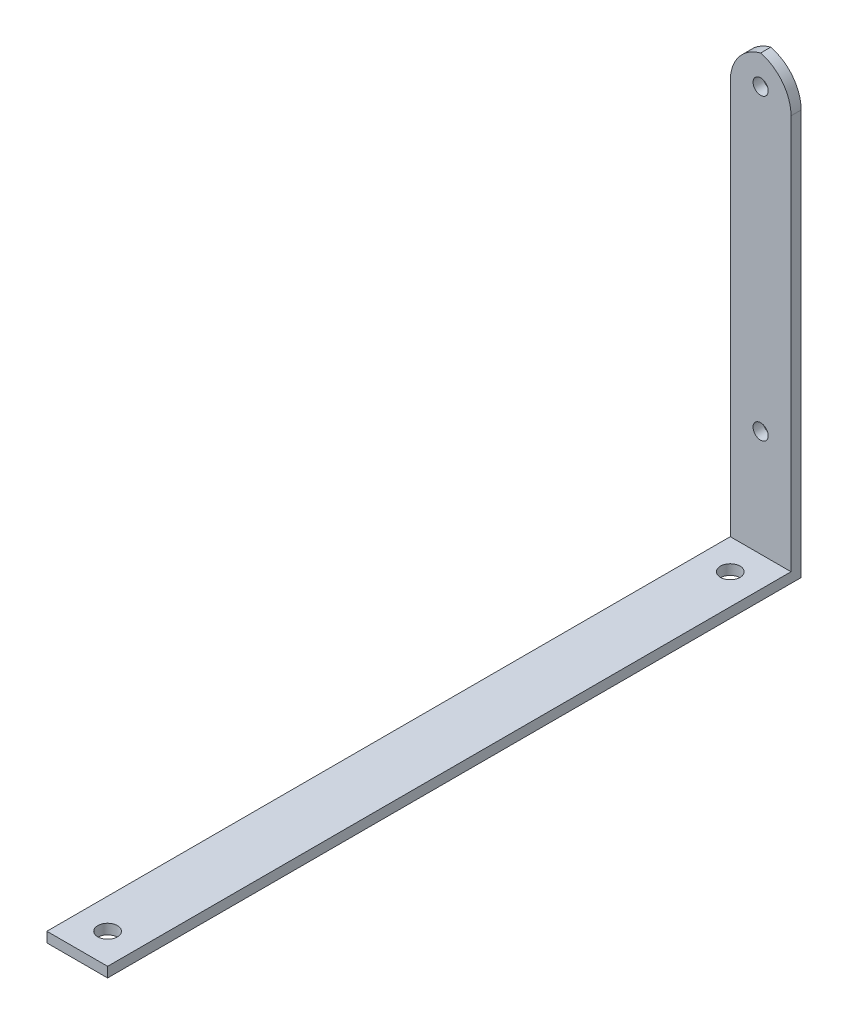
ISO-10303-21;
HEADER;
FILE_DESCRIPTION(('STEP AP214'),'2;1');
FILE_NAME('part.step','',(''),(''),'','','');
FILE_SCHEMA(('AUTOMOTIVE_DESIGN { 1 0 10303 214 1 1 1 1 }'));
ENDSEC;
DATA;
#1=APPLICATION_CONTEXT('core data for automotive mechanical design processes');
#2=APPLICATION_PROTOCOL_DEFINITION('international standard','automotive_design',2000,#1);
#3=PRODUCT_CONTEXT('',#1,'mechanical');
#4=PRODUCT('Part','Part','',(#3));
#5=PRODUCT_RELATED_PRODUCT_CATEGORY('part','',(#4));
#6=PRODUCT_DEFINITION_FORMATION('','',#4);
#7=PRODUCT_DEFINITION_CONTEXT('part definition',#1,'design');
#8=PRODUCT_DEFINITION('design','',#6,#7);
#9=PRODUCT_DEFINITION_SHAPE('','',#8);
#10=(LENGTH_UNIT() NAMED_UNIT(*) SI_UNIT(.MILLI.,.METRE.));
#11=(NAMED_UNIT(*) PLANE_ANGLE_UNIT() SI_UNIT($,.RADIAN.));
#12=(NAMED_UNIT(*) SI_UNIT($,.STERADIAN.) SOLID_ANGLE_UNIT());
#13=UNCERTAINTY_MEASURE_WITH_UNIT(LENGTH_MEASURE(1.E-05),#10,'distance_accuracy_value','');
#14=(GEOMETRIC_REPRESENTATION_CONTEXT(3) GLOBAL_UNCERTAINTY_ASSIGNED_CONTEXT((#13)) GLOBAL_UNIT_ASSIGNED_CONTEXT((#10,
#11,#12)) REPRESENTATION_CONTEXT('',''));
#15=CARTESIAN_POINT('',(0.,0.,0.));
#16=DIRECTION('',(0.,0.,1.));
#17=DIRECTION('',(1.,0.,0.));
#18=AXIS2_PLACEMENT_3D('',#15,#16,#17);
#19=CARTESIAN_POINT('',(0.,0.,2.));
#20=DIRECTION('',(0.,0.,-1.));
#21=DIRECTION('',(-1.,0.,0.));
#22=AXIS2_PLACEMENT_3D('',#19,#20,#21);
#23=PLANE('',#22);
#24=CARTESIAN_POINT('',(6.,23.,2.));
#25=DIRECTION('',(0.,0.,1.));
#26=DIRECTION('',(1.,0.,0.));
#27=AXIS2_PLACEMENT_3D('',#24,#25,#26);
#28=CIRCLE('',#27,1.5);
#29=CARTESIAN_POINT('',(7.5,23.,2.));
#30=VERTEX_POINT('',#29);
#31=EDGE_CURVE('E127',#30,#30,#28,.T.);
#32=ORIENTED_EDGE('',*,*,#31,.F.);
#33=EDGE_LOOP('',(#32));
#34=FACE_BOUND('',#33,.T.);
#35=CARTESIAN_POINT('',(6.,82.,2.));
#36=DIRECTION('',(0.,0.,1.));
#37=DIRECTION('',(1.,0.,0.));
#38=AXIS2_PLACEMENT_3D('',#35,#36,#37);
#39=CIRCLE('',#38,1.5);
#40=CARTESIAN_POINT('',(7.5,82.,2.));
#41=VERTEX_POINT('',#40);
#42=EDGE_CURVE('E161',#41,#41,#39,.T.);
#43=ORIENTED_EDGE('',*,*,#42,.F.);
#44=EDGE_LOOP('',(#43));
#45=FACE_BOUND('',#44,.T.);
#46=DIRECTION('',(0.,1.,0.));
#47=VECTOR('',#46,1.);
#48=CARTESIAN_POINT('',(12.,0.,2.));
#49=LINE('',#48,#47);
#50=CARTESIAN_POINT('',(12.,2.,2.));
#51=VERTEX_POINT('',#50);
#52=CARTESIAN_POINT('',(12.,80.,2.));
#53=VERTEX_POINT('',#52);
#54=EDGE_CURVE('E131',#51,#53,#49,.T.);
#55=ORIENTED_EDGE('',*,*,#54,.T.);
#56=CARTESIAN_POINT('',(4.,80.,2.));
#57=DIRECTION('',(0.,0.,-1.));
#58=DIRECTION('',(-1.,0.,0.));
#59=AXIS2_PLACEMENT_3D('',#56,#57,#58);
#60=CIRCLE('',#59,8.);
#61=CARTESIAN_POINT('',(6.,87.7459666924148,2.));
#62=VERTEX_POINT('',#61);
#63=EDGE_CURVE('E42',#53,#62,#60,.F.);
#64=ORIENTED_EDGE('',*,*,#63,.T.);
#65=CARTESIAN_POINT('',(8.,80.,2.));
#66=DIRECTION('',(0.,0.,-1.));
#67=DIRECTION('',(-1.,0.,0.));
#68=AXIS2_PLACEMENT_3D('',#65,#66,#67);
#69=CIRCLE('',#68,8.);
#70=CARTESIAN_POINT('',(0.,80.,2.));
#71=VERTEX_POINT('',#70);
#72=EDGE_CURVE('E52',#62,#71,#69,.F.);
#73=ORIENTED_EDGE('',*,*,#72,.T.);
#74=DIRECTION('',(0.,-1.,0.));
#75=VECTOR('',#74,1.);
#76=CARTESIAN_POINT('',(0.,0.,2.));
#77=LINE('',#76,#75);
#78=CARTESIAN_POINT('',(0.,2.,2.));
#79=VERTEX_POINT('',#78);
#80=EDGE_CURVE('E148',#71,#79,#77,.T.);
#81=ORIENTED_EDGE('',*,*,#80,.T.);
#82=DIRECTION('',(-1.,0.,0.));
#83=VECTOR('',#82,1.);
#84=CARTESIAN_POINT('',(0.,2.,2.));
#85=LINE('',#84,#83);
#86=EDGE_CURVE('E114',#51,#79,#85,.T.);
#87=ORIENTED_EDGE('',*,*,#86,.F.);
#88=EDGE_LOOP('',(#55,#64,#73,#81,#87));
#89=FACE_BOUND('',#88,.T.);
#90=ADVANCED_FACE('F33',(#34,#45,#89),#23,.F.);
#91=CARTESIAN_POINT('',(0.,0.,0.));
#92=DIRECTION('',(0.,0.,-1.));
#93=DIRECTION('',(-1.,0.,0.));
#94=AXIS2_PLACEMENT_3D('',#91,#92,#93);
#95=PLANE('',#94);
#96=CARTESIAN_POINT('',(6.,82.,0.));
#97=DIRECTION('',(0.,0.,1.));
#98=DIRECTION('',(1.,0.,0.));
#99=AXIS2_PLACEMENT_3D('',#96,#97,#98);
#100=CIRCLE('',#99,1.5);
#101=CARTESIAN_POINT('',(7.5,82.,0.));
#102=VERTEX_POINT('',#101);
#103=EDGE_CURVE('E155',#102,#102,#100,.T.);
#104=ORIENTED_EDGE('',*,*,#103,.T.);
#105=EDGE_LOOP('',(#104));
#106=FACE_BOUND('',#105,.T.);
#107=CARTESIAN_POINT('',(8.,80.,0.));
#108=DIRECTION('',(0.,0.,-1.));
#109=DIRECTION('',(-1.,0.,0.));
#110=AXIS2_PLACEMENT_3D('',#107,#108,#109);
#111=CIRCLE('',#110,8.);
#112=CARTESIAN_POINT('',(0.,80.,0.));
#113=VERTEX_POINT('',#112);
#114=CARTESIAN_POINT('',(6.,87.7459666924148,0.));
#115=VERTEX_POINT('',#114);
#116=EDGE_CURVE('E99',#113,#115,#111,.T.);
#117=ORIENTED_EDGE('',*,*,#116,.T.);
#118=CARTESIAN_POINT('',(4.,80.,0.));
#119=DIRECTION('',(0.,0.,-1.));
#120=DIRECTION('',(-1.,0.,0.));
#121=AXIS2_PLACEMENT_3D('',#118,#119,#120);
#122=CIRCLE('',#121,8.);
#123=CARTESIAN_POINT('',(12.,80.,0.));
#124=VERTEX_POINT('',#123);
#125=EDGE_CURVE('E143',#115,#124,#122,.T.);
#126=ORIENTED_EDGE('',*,*,#125,.T.);
#127=DIRECTION('',(0.,1.,0.));
#128=VECTOR('',#127,1.);
#129=CARTESIAN_POINT('',(12.,0.,0.));
#130=LINE('',#129,#128);
#131=CARTESIAN_POINT('',(12.,0.,0.));
#132=VERTEX_POINT('',#131);
#133=EDGE_CURVE('E151',#132,#124,#130,.T.);
#134=ORIENTED_EDGE('',*,*,#133,.F.);
#135=DIRECTION('',(1.,0.,0.));
#136=VECTOR('',#135,1.);
#137=CARTESIAN_POINT('',(0.,0.,0.));
#138=LINE('',#137,#136);
#139=CARTESIAN_POINT('',(0.,0.,0.));
#140=VERTEX_POINT('',#139);
#141=EDGE_CURVE('E160',#140,#132,#138,.T.);
#142=ORIENTED_EDGE('',*,*,#141,.F.);
#143=DIRECTION('',(0.,-1.,0.));
#144=VECTOR('',#143,1.);
#145=CARTESIAN_POINT('',(0.,0.,0.));
#146=LINE('',#145,#144);
#147=EDGE_CURVE('E96',#113,#140,#146,.T.);
#148=ORIENTED_EDGE('',*,*,#147,.F.);
#149=EDGE_LOOP('',(#117,#126,#134,#142,#148));
#150=FACE_BOUND('',#149,.T.);
#151=CARTESIAN_POINT('',(6.,23.,0.));
#152=DIRECTION('',(0.,0.,1.));
#153=DIRECTION('',(1.,0.,0.));
#154=AXIS2_PLACEMENT_3D('',#151,#152,#153);
#155=CIRCLE('',#154,1.5);
#156=CARTESIAN_POINT('',(7.5,23.,0.));
#157=VERTEX_POINT('',#156);
#158=EDGE_CURVE('E139',#157,#157,#155,.T.);
#159=ORIENTED_EDGE('',*,*,#158,.T.);
#160=EDGE_LOOP('',(#159));
#161=FACE_BOUND('',#160,.T.);
#162=ADVANCED_FACE('F180',(#106,#150,#161),#95,.T.);
#163=CARTESIAN_POINT('',(0.,0.,2.));
#164=DIRECTION('',(1.,0.,0.));
#165=DIRECTION('',(0.,0.,-1.));
#166=AXIS2_PLACEMENT_3D('',#163,#164,#165);
#167=PLANE('',#166);
#168=ORIENTED_EDGE('',*,*,#80,.F.);
#169=DIRECTION('',(0.,0.,-1.));
#170=VECTOR('',#169,1.);
#171=CARTESIAN_POINT('',(0.,80.,2.));
#172=LINE('',#171,#170);
#173=EDGE_CURVE('E11',#71,#113,#172,.T.);
#174=ORIENTED_EDGE('',*,*,#173,.T.);
#175=ORIENTED_EDGE('',*,*,#147,.T.);
#176=DIRECTION('',(0.,0.,-1.));
#177=VECTOR('',#176,1.);
#178=CARTESIAN_POINT('',(0.,0.,2.));
#179=LINE('',#178,#177);
#180=CARTESIAN_POINT('',(0.,0.,137.));
#181=VERTEX_POINT('',#180);
#182=EDGE_CURVE('E89',#181,#140,#179,.T.);
#183=ORIENTED_EDGE('',*,*,#182,.F.);
#184=DIRECTION('',(0.,-1.,0.));
#185=VECTOR('',#184,1.);
#186=CARTESIAN_POINT('',(0.,0.,137.));
#187=LINE('',#186,#185);
#188=CARTESIAN_POINT('',(0.,2.,137.));
#189=VERTEX_POINT('',#188);
#190=EDGE_CURVE('E94',#189,#181,#187,.T.);
#191=ORIENTED_EDGE('',*,*,#190,.F.);
#192=DIRECTION('',(0.,0.,-1.));
#193=VECTOR('',#192,1.);
#194=CARTESIAN_POINT('',(0.,2.,137.));
#195=LINE('',#194,#193);
#196=EDGE_CURVE('E124',#189,#79,#195,.T.);
#197=ORIENTED_EDGE('',*,*,#196,.T.);
#198=EDGE_LOOP('',(#168,#174,#175,#183,#191,#197));
#199=FACE_BOUND('',#198,.T.);
#200=ADVANCED_FACE('F91',(#199),#167,.F.);
#201=CARTESIAN_POINT('',(0.,0.,2.));
#202=DIRECTION('',(0.,1.,0.));
#203=DIRECTION('',(0.,0.,1.));
#204=AXIS2_PLACEMENT_3D('',#201,#202,#203);
#205=PLANE('',#204);
#206=CARTESIAN_POINT('',(6.,0.,8.00000000000001));
#207=DIRECTION('',(0.,1.,0.));
#208=DIRECTION('',(0.,0.,1.));
#209=AXIS2_PLACEMENT_3D('',#206,#207,#208);
#210=CIRCLE('',#209,1.9394006982284);
#211=CARTESIAN_POINT('',(6.,0.,9.93940069822841));
#212=VERTEX_POINT('',#211);
#213=EDGE_CURVE('E189',#212,#212,#210,.T.);
#214=ORIENTED_EDGE('',*,*,#213,.T.);
#215=EDGE_LOOP('',(#214));
#216=FACE_BOUND('',#215,.T.);
#217=CARTESIAN_POINT('',(6.,0.,131.));
#218=DIRECTION('',(0.,1.,0.));
#219=DIRECTION('',(0.,0.,1.));
#220=AXIS2_PLACEMENT_3D('',#217,#218,#219);
#221=CIRCLE('',#220,1.9394006982284);
#222=CARTESIAN_POINT('',(6.,0.,132.939400698228));
#223=VERTEX_POINT('',#222);
#224=EDGE_CURVE('E184',#223,#223,#221,.T.);
#225=ORIENTED_EDGE('',*,*,#224,.T.);
#226=EDGE_LOOP('',(#225));
#227=FACE_BOUND('',#226,.T.);
#228=ORIENTED_EDGE('',*,*,#141,.T.);
#229=DIRECTION('',(0.,0.,-1.));
#230=VECTOR('',#229,1.);
#231=CARTESIAN_POINT('',(12.,0.,2.));
#232=LINE('',#231,#230);
#233=CARTESIAN_POINT('',(12.,0.,137.));
#234=VERTEX_POINT('',#233);
#235=EDGE_CURVE('E100',#234,#132,#232,.T.);
#236=ORIENTED_EDGE('',*,*,#235,.F.);
#237=DIRECTION('',(1.,0.,0.));
#238=VECTOR('',#237,1.);
#239=CARTESIAN_POINT('',(0.,0.,137.));
#240=LINE('',#239,#238);
#241=EDGE_CURVE('E103',#181,#234,#240,.T.);
#242=ORIENTED_EDGE('',*,*,#241,.F.);
#243=ORIENTED_EDGE('',*,*,#182,.T.);
#244=EDGE_LOOP('',(#228,#236,#242,#243));
#245=FACE_BOUND('',#244,.T.);
#246=ADVANCED_FACE('F104',(#216,#227,#245),#205,.F.);
#247=CARTESIAN_POINT('',(12.,0.,2.));
#248=DIRECTION('',(-1.,0.,0.));
#249=DIRECTION('',(0.,0.,1.));
#250=AXIS2_PLACEMENT_3D('',#247,#248,#249);
#251=PLANE('',#250);
#252=ORIENTED_EDGE('',*,*,#133,.T.);
#253=DIRECTION('',(0.,0.,-1.));
#254=VECTOR('',#253,1.);
#255=CARTESIAN_POINT('',(12.,80.,2.));
#256=LINE('',#255,#254);
#257=EDGE_CURVE('E145',#124,#53,#256,.F.);
#258=ORIENTED_EDGE('',*,*,#257,.T.);
#259=ORIENTED_EDGE('',*,*,#54,.F.);
#260=DIRECTION('',(0.,0.,-1.));
#261=VECTOR('',#260,1.);
#262=CARTESIAN_POINT('',(12.,2.,137.));
#263=LINE('',#262,#261);
#264=CARTESIAN_POINT('',(12.,2.,137.));
#265=VERTEX_POINT('',#264);
#266=EDGE_CURVE('E134',#265,#51,#263,.T.);
#267=ORIENTED_EDGE('',*,*,#266,.F.);
#268=DIRECTION('',(0.,1.,0.));
#269=VECTOR('',#268,1.);
#270=CARTESIAN_POINT('',(12.,0.,137.));
#271=LINE('',#270,#269);
#272=EDGE_CURVE('E108',#234,#265,#271,.T.);
#273=ORIENTED_EDGE('',*,*,#272,.F.);
#274=ORIENTED_EDGE('',*,*,#235,.T.);
#275=EDGE_LOOP('',(#252,#258,#259,#267,#273,#274));
#276=FACE_BOUND('',#275,.T.);
#277=ADVANCED_FACE('F169',(#276),#251,.F.);
#278=CARTESIAN_POINT('',(6.,82.,2.));
#279=DIRECTION('',(0.,0.,-1.));
#280=DIRECTION('',(-1.,0.,0.));
#281=AXIS2_PLACEMENT_3D('',#278,#279,#280);
#282=CYLINDRICAL_SURFACE('',#281,1.5);
#283=ORIENTED_EDGE('',*,*,#42,.T.);
#284=EDGE_LOOP('',(#283));
#285=FACE_BOUND('',#284,.T.);
#286=ORIENTED_EDGE('',*,*,#103,.F.);
#287=EDGE_LOOP('',(#286));
#288=FACE_BOUND('',#287,.T.);
#289=ADVANCED_FACE('F229',(#285,#288),#282,.F.);
#290=CARTESIAN_POINT('',(6.,23.,2.));
#291=DIRECTION('',(0.,0.,-1.));
#292=DIRECTION('',(-1.,0.,0.));
#293=AXIS2_PLACEMENT_3D('',#290,#291,#292);
#294=CYLINDRICAL_SURFACE('',#293,1.5);
#295=ORIENTED_EDGE('',*,*,#31,.T.);
#296=EDGE_LOOP('',(#295));
#297=FACE_BOUND('',#296,.T.);
#298=ORIENTED_EDGE('',*,*,#158,.F.);
#299=EDGE_LOOP('',(#298));
#300=FACE_BOUND('',#299,.T.);
#301=ADVANCED_FACE('F207',(#297,#300),#294,.F.);
#302=CARTESIAN_POINT('',(0.,2.,137.));
#303=DIRECTION('',(0.,-1.,0.));
#304=DIRECTION('',(0.,0.,-1.));
#305=AXIS2_PLACEMENT_3D('',#302,#303,#304);
#306=PLANE('',#305);
#307=CARTESIAN_POINT('',(6.,2.,8.00000000000001));
#308=DIRECTION('',(0.,1.,0.));
#309=DIRECTION('',(0.,0.,1.));
#310=AXIS2_PLACEMENT_3D('',#307,#308,#309);
#311=CIRCLE('',#310,1.9394006982284);
#312=CARTESIAN_POINT('',(6.,2.,9.93940069822841));
#313=VERTEX_POINT('',#312);
#314=EDGE_CURVE('E191',#313,#313,#311,.T.);
#315=ORIENTED_EDGE('',*,*,#314,.F.);
#316=EDGE_LOOP('',(#315));
#317=FACE_BOUND('',#316,.T.);
#318=CARTESIAN_POINT('',(6.,2.,131.));
#319=DIRECTION('',(0.,1.,0.));
#320=DIRECTION('',(0.,0.,1.));
#321=AXIS2_PLACEMENT_3D('',#318,#319,#320);
#322=CIRCLE('',#321,1.9394006982284);
#323=CARTESIAN_POINT('',(6.,2.,132.939400698228));
#324=VERTEX_POINT('',#323);
#325=EDGE_CURVE('E119',#324,#324,#322,.T.);
#326=ORIENTED_EDGE('',*,*,#325,.F.);
#327=EDGE_LOOP('',(#326));
#328=FACE_BOUND('',#327,.T.);
#329=ORIENTED_EDGE('',*,*,#86,.T.);
#330=ORIENTED_EDGE('',*,*,#196,.F.);
#331=DIRECTION('',(-1.,0.,0.));
#332=VECTOR('',#331,1.);
#333=CARTESIAN_POINT('',(0.,2.,137.));
#334=LINE('',#333,#332);
#335=EDGE_CURVE('E112',#265,#189,#334,.T.);
#336=ORIENTED_EDGE('',*,*,#335,.F.);
#337=ORIENTED_EDGE('',*,*,#266,.T.);
#338=EDGE_LOOP('',(#329,#330,#336,#337));
#339=FACE_BOUND('',#338,.T.);
#340=ADVANCED_FACE('F172',(#317,#328,#339),#306,.F.);
#341=CARTESIAN_POINT('',(0.,0.,137.));
#342=DIRECTION('',(0.,0.,-1.));
#343=DIRECTION('',(-1.,0.,0.));
#344=AXIS2_PLACEMENT_3D('',#341,#342,#343);
#345=PLANE('',#344);
#346=ORIENTED_EDGE('',*,*,#190,.T.);
#347=ORIENTED_EDGE('',*,*,#241,.T.);
#348=ORIENTED_EDGE('',*,*,#272,.T.);
#349=ORIENTED_EDGE('',*,*,#335,.T.);
#350=EDGE_LOOP('',(#346,#347,#348,#349));
#351=FACE_BOUND('',#350,.T.);
#352=ADVANCED_FACE('F110',(#351),#345,.F.);
#353=CARTESIAN_POINT('',(8.,80.,2.));
#354=DIRECTION('',(0.,0.,-1.));
#355=DIRECTION('',(-1.,0.,0.));
#356=AXIS2_PLACEMENT_3D('',#353,#354,#355);
#357=CYLINDRICAL_SURFACE('',#356,8.);
#358=ORIENTED_EDGE('',*,*,#173,.F.);
#359=ORIENTED_EDGE('',*,*,#72,.F.);
#360=DIRECTION('',(0.,0.,-1.));
#361=VECTOR('',#360,1.);
#362=CARTESIAN_POINT('',(6.,87.7459666924148,1.));
#363=LINE('',#362,#361);
#364=EDGE_CURVE('E37',#115,#62,#363,.F.);
#365=ORIENTED_EDGE('',*,*,#364,.F.);
#366=ORIENTED_EDGE('',*,*,#116,.F.);
#367=EDGE_LOOP('',(#358,#359,#365,#366));
#368=FACE_BOUND('',#367,.T.);
#369=ADVANCED_FACE('F35',(#368),#357,.T.);
#370=CARTESIAN_POINT('',(4.,80.,2.));
#371=DIRECTION('',(0.,0.,-1.));
#372=DIRECTION('',(-1.,0.,0.));
#373=AXIS2_PLACEMENT_3D('',#370,#371,#372);
#374=CYLINDRICAL_SURFACE('',#373,8.);
#375=ORIENTED_EDGE('',*,*,#63,.F.);
#376=ORIENTED_EDGE('',*,*,#257,.F.);
#377=ORIENTED_EDGE('',*,*,#125,.F.);
#378=ORIENTED_EDGE('',*,*,#364,.T.);
#379=EDGE_LOOP('',(#375,#376,#377,#378));
#380=FACE_BOUND('',#379,.T.);
#381=ADVANCED_FACE('F183',(#380),#374,.T.);
#382=CARTESIAN_POINT('',(6.,0.,131.));
#383=DIRECTION('',(0.,1.,0.));
#384=DIRECTION('',(0.,0.,1.));
#385=AXIS2_PLACEMENT_3D('',#382,#383,#384);
#386=CYLINDRICAL_SURFACE('',#385,1.9394006982284);
#387=ORIENTED_EDGE('',*,*,#224,.F.);
#388=EDGE_LOOP('',(#387));
#389=FACE_BOUND('',#388,.T.);
#390=ORIENTED_EDGE('',*,*,#325,.T.);
#391=EDGE_LOOP('',(#390));
#392=FACE_BOUND('',#391,.T.);
#393=ADVANCED_FACE('F201',(#389,#392),#386,.F.);
#394=CARTESIAN_POINT('',(6.,0.,8.00000000000001));
#395=DIRECTION('',(0.,1.,0.));
#396=DIRECTION('',(0.,0.,1.));
#397=AXIS2_PLACEMENT_3D('',#394,#395,#396);
#398=CYLINDRICAL_SURFACE('',#397,1.9394006982284);
#399=ORIENTED_EDGE('',*,*,#213,.F.);
#400=EDGE_LOOP('',(#399));
#401=FACE_BOUND('',#400,.T.);
#402=ORIENTED_EDGE('',*,*,#314,.T.);
#403=EDGE_LOOP('',(#402));
#404=FACE_BOUND('',#403,.T.);
#405=ADVANCED_FACE('F198',(#401,#404),#398,.F.);
#406=CLOSED_SHELL('',(#90,#162,#200,#246,#277,#289,#301,#340,#352,#369,#381,#393,#405));
#407=MANIFOLD_SOLID_BREP('B2',#406);
#408=ADVANCED_BREP_SHAPE_REPRESENTATION('',(#18,#407),#14);
#409=SHAPE_DEFINITION_REPRESENTATION(#9,#408);
ENDSEC;
END-ISO-10303-21;
